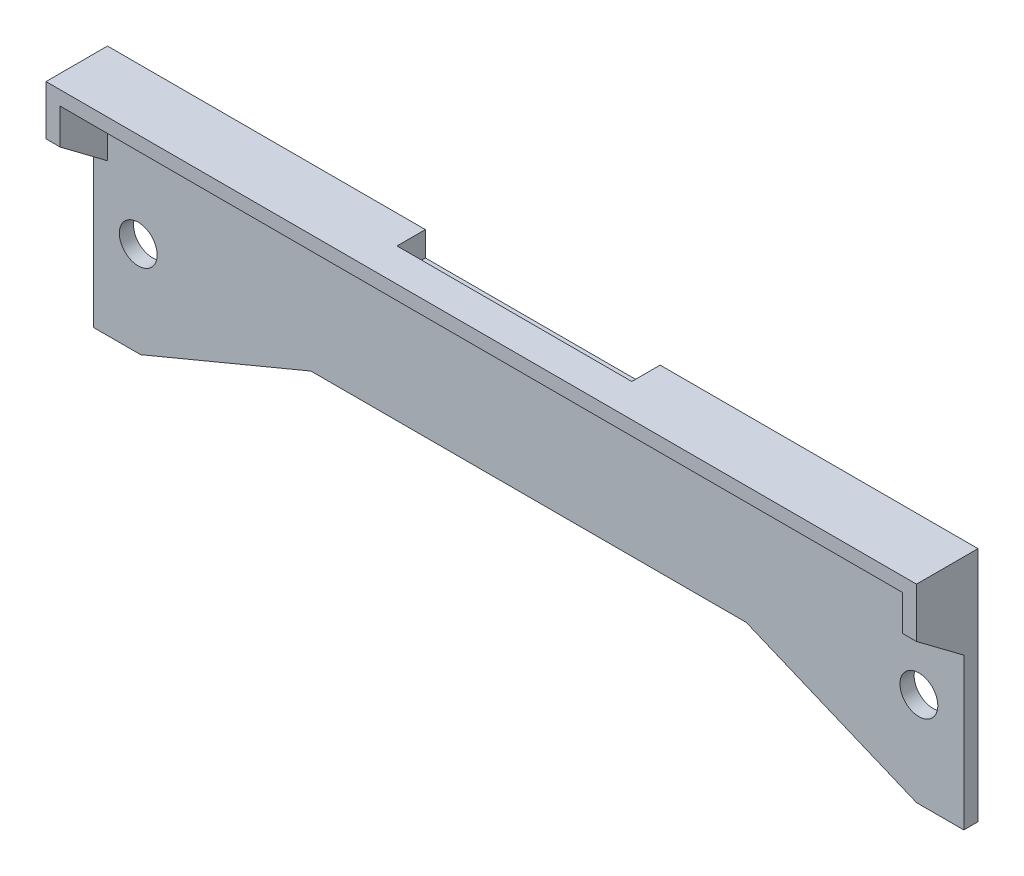
ISO-10303-21;
HEADER;
FILE_DESCRIPTION(('STEP AP214'),'2;1');
FILE_NAME('part.step','',(''),(''),'','','');
FILE_SCHEMA(('AUTOMOTIVE_DESIGN { 1 0 10303 214 1 1 1 1 }'));
ENDSEC;
DATA;
#1=APPLICATION_CONTEXT('core data for automotive mechanical design processes');
#2=APPLICATION_PROTOCOL_DEFINITION('international standard','automotive_design',2000,#1);
#3=PRODUCT_CONTEXT('',#1,'mechanical');
#4=PRODUCT('Part','Part','',(#3));
#5=PRODUCT_RELATED_PRODUCT_CATEGORY('part','',(#4));
#6=PRODUCT_DEFINITION_FORMATION('','',#4);
#7=PRODUCT_DEFINITION_CONTEXT('part definition',#1,'design');
#8=PRODUCT_DEFINITION('design','',#6,#7);
#9=PRODUCT_DEFINITION_SHAPE('','',#8);
#10=(LENGTH_UNIT() NAMED_UNIT(*) SI_UNIT(.MILLI.,.METRE.));
#11=(NAMED_UNIT(*) PLANE_ANGLE_UNIT() SI_UNIT($,.RADIAN.));
#12=(NAMED_UNIT(*) SI_UNIT($,.STERADIAN.) SOLID_ANGLE_UNIT());
#13=UNCERTAINTY_MEASURE_WITH_UNIT(LENGTH_MEASURE(1.E-05),#10,'distance_accuracy_value','');
#14=(GEOMETRIC_REPRESENTATION_CONTEXT(3) GLOBAL_UNCERTAINTY_ASSIGNED_CONTEXT((#13)) GLOBAL_UNIT_ASSIGNED_CONTEXT((#10,
#11,#12)) REPRESENTATION_CONTEXT('',''));
#15=CARTESIAN_POINT('',(0.,0.,0.));
#16=DIRECTION('',(0.,0.,1.));
#17=DIRECTION('',(1.,0.,0.));
#18=AXIS2_PLACEMENT_3D('',#15,#16,#17);
#19=CARTESIAN_POINT('',(0.,0.,3.));
#20=DIRECTION('',(0.,0.,-1.));
#21=DIRECTION('',(-1.,0.,0.));
#22=AXIS2_PLACEMENT_3D('',#19,#20,#21);
#23=PLANE('',#22);
#24=CARTESIAN_POINT('',(9.5,20.,3.));
#25=DIRECTION('',(0.,0.,1.));
#26=DIRECTION('',(1.,0.,0.));
#27=AXIS2_PLACEMENT_3D('',#24,#25,#26);
#28=CIRCLE('',#27,4.00000000000001);
#29=CARTESIAN_POINT('',(13.5,20.,3.));
#30=VERTEX_POINT('',#29);
#31=EDGE_CURVE('E282',#30,#30,#28,.T.);
#32=ORIENTED_EDGE('',*,*,#31,.F.);
#33=EDGE_LOOP('',(#32));
#34=FACE_BOUND('',#33,.T.);
#35=CARTESIAN_POINT('',(174.5,20.,3.));
#36=DIRECTION('',(0.,0.,1.));
#37=DIRECTION('',(-1.,0.,0.));
#38=AXIS2_PLACEMENT_3D('',#35,#36,#37);
#39=CIRCLE('',#38,3.99999999999999);
#40=CARTESIAN_POINT('',(170.5,20.,3.));
#41=VERTEX_POINT('',#40);
#42=EDGE_CURVE('E276',#41,#41,#39,.T.);
#43=ORIENTED_EDGE('',*,*,#42,.F.);
#44=EDGE_LOOP('',(#43));
#45=FACE_BOUND('',#44,.T.);
#46=DIRECTION('',(0.923076923076923,-0.384615384615384,0.));
#47=VECTOR('',#46,1.);
#48=CARTESIAN_POINT('',(25.7396449704142,61.7751479289941,3.));
#49=LINE('',#48,#47);
#50=CARTESIAN_POINT('',(138.,15.,3.));
#51=VERTEX_POINT('',#50);
#52=CARTESIAN_POINT('',(174.,0.,3.));
#53=VERTEX_POINT('',#52);
#54=EDGE_CURVE('E181',#51,#53,#49,.T.);
#55=ORIENTED_EDGE('',*,*,#54,.T.);
#56=DIRECTION('',(1.,0.,0.));
#57=VECTOR('',#56,1.);
#58=CARTESIAN_POINT('',(0.,0.,3.));
#59=LINE('',#58,#57);
#60=CARTESIAN_POINT('',(184.,0.,3.));
#61=VERTEX_POINT('',#60);
#62=EDGE_CURVE('E290',#53,#61,#59,.T.);
#63=ORIENTED_EDGE('',*,*,#62,.T.);
#64=DIRECTION('',(0.,1.,0.));
#65=VECTOR('',#64,1.);
#66=CARTESIAN_POINT('',(184.,0.,3.));
#67=LINE('',#66,#65);
#68=CARTESIAN_POINT('',(184.,32.,3.));
#69=VERTEX_POINT('',#68);
#70=EDGE_CURVE('E294',#61,#69,#67,.T.);
#71=ORIENTED_EDGE('',*,*,#70,.T.);
#72=DIRECTION('',(1.,0.,0.));
#73=VECTOR('',#72,1.);
#74=CARTESIAN_POINT('',(181.,32.,3.));
#75=LINE('',#74,#73);
#76=CARTESIAN_POINT('',(181.,32.,3.));
#77=VERTEX_POINT('',#76);
#78=EDGE_CURVE('E253',#77,#69,#75,.T.);
#79=ORIENTED_EDGE('',*,*,#78,.F.);
#80=DIRECTION('',(0.,1.,0.));
#81=VECTOR('',#80,1.);
#82=CARTESIAN_POINT('',(181.,32.,3.));
#83=LINE('',#82,#81);
#84=CARTESIAN_POINT('',(181.,47.,3.));
#85=VERTEX_POINT('',#84);
#86=EDGE_CURVE('E250',#77,#85,#83,.T.);
#87=ORIENTED_EDGE('',*,*,#86,.T.);
#88=DIRECTION('',(1.,0.,0.));
#89=VECTOR('',#88,1.);
#90=CARTESIAN_POINT('',(0.,47.,3.));
#91=LINE('',#90,#89);
#92=CARTESIAN_POINT('',(116.811209828697,47.,3.));
#93=VERTEX_POINT('',#92);
#94=EDGE_CURVE('E271',#93,#85,#91,.T.);
#95=ORIENTED_EDGE('',*,*,#94,.F.);
#96=DIRECTION('',(0.,-1.,0.));
#97=VECTOR('',#96,1.);
#98=CARTESIAN_POINT('',(116.811209828697,0.,3.));
#99=LINE('',#98,#97);
#100=CARTESIAN_POINT('',(116.811209828697,44.8066347129542,3.));
#101=VERTEX_POINT('',#100);
#102=EDGE_CURVE('E235',#93,#101,#99,.T.);
#103=ORIENTED_EDGE('',*,*,#102,.T.);
#104=DIRECTION('',(-1.,0.,0.));
#105=VECTOR('',#104,1.);
#106=CARTESIAN_POINT('',(0.,44.8066347129542,3.));
#107=LINE('',#106,#105);
#108=CARTESIAN_POINT('',(67.1887901713027,44.8066347129542,3.));
#109=VERTEX_POINT('',#108);
#110=EDGE_CURVE('E241',#101,#109,#107,.T.);
#111=ORIENTED_EDGE('',*,*,#110,.T.);
#112=DIRECTION('',(0.,1.,0.));
#113=VECTOR('',#112,1.);
#114=CARTESIAN_POINT('',(67.1887901713027,0.,3.));
#115=LINE('',#114,#113);
#116=CARTESIAN_POINT('',(67.1887901713027,47.,3.));
#117=VERTEX_POINT('',#116);
#118=EDGE_CURVE('E229',#109,#117,#115,.T.);
#119=ORIENTED_EDGE('',*,*,#118,.T.);
#120=CARTESIAN_POINT('',(3.,47.,3.));
#121=VERTEX_POINT('',#120);
#122=EDGE_CURVE('E272',#121,#117,#91,.T.);
#123=ORIENTED_EDGE('',*,*,#122,.F.);
#124=DIRECTION('',(0.,-1.,0.));
#125=VECTOR('',#124,1.);
#126=CARTESIAN_POINT('',(3.,47.,3.));
#127=LINE('',#126,#125);
#128=CARTESIAN_POINT('',(3.,32.,3.));
#129=VERTEX_POINT('',#128);
#130=EDGE_CURVE('E263',#121,#129,#127,.T.);
#131=ORIENTED_EDGE('',*,*,#130,.T.);
#132=DIRECTION('',(-1.,0.,0.));
#133=VECTOR('',#132,1.);
#134=CARTESIAN_POINT('',(3.,32.,3.));
#135=LINE('',#134,#133);
#136=CARTESIAN_POINT('',(0.,32.,3.));
#137=VERTEX_POINT('',#136);
#138=EDGE_CURVE('E266',#129,#137,#135,.T.);
#139=ORIENTED_EDGE('',*,*,#138,.T.);
#140=DIRECTION('',(0.,-1.,0.));
#141=VECTOR('',#140,1.);
#142=CARTESIAN_POINT('',(0.,0.,3.));
#143=LINE('',#142,#141);
#144=CARTESIAN_POINT('',(0.,0.,3.));
#145=VERTEX_POINT('',#144);
#146=EDGE_CURVE('E288',#137,#145,#143,.T.);
#147=ORIENTED_EDGE('',*,*,#146,.T.);
#148=CARTESIAN_POINT('',(10.,0.,3.));
#149=VERTEX_POINT('',#148);
#150=EDGE_CURVE('E292',#145,#149,#59,.T.);
#151=ORIENTED_EDGE('',*,*,#150,.T.);
#152=DIRECTION('',(-0.923076923076923,-0.384615384615384,0.));
#153=VECTOR('',#152,1.);
#154=CARTESIAN_POINT('',(1.4792899408284,-3.55029585798816,3.));
#155=LINE('',#154,#153);
#156=CARTESIAN_POINT('',(46.,15.,3.));
#157=VERTEX_POINT('',#156);
#158=EDGE_CURVE('E48',#157,#149,#155,.T.);
#159=ORIENTED_EDGE('',*,*,#158,.F.);
#160=DIRECTION('',(-1.,0.,0.));
#161=VECTOR('',#160,1.);
#162=CARTESIAN_POINT('',(0.,15.,3.));
#163=LINE('',#162,#161);
#164=EDGE_CURVE('E174',#51,#157,#163,.T.);
#165=ORIENTED_EDGE('',*,*,#164,.F.);
#166=EDGE_LOOP('',(#55,#63,#71,#79,#87,#95,#103,#111,#119,#123,#131,#139,#147,#151,#159,#165));
#167=FACE_BOUND('',#166,.T.);
#168=ADVANCED_FACE('F33',(#34,#45,#167),#23,.F.);
#169=CARTESIAN_POINT('',(0.,0.,0.));
#170=DIRECTION('',(0.,0.,-1.));
#171=DIRECTION('',(-1.,0.,0.));
#172=AXIS2_PLACEMENT_3D('',#169,#170,#171);
#173=PLANE('',#172);
#174=CARTESIAN_POINT('',(9.5,20.,0.));
#175=DIRECTION('',(0.,0.,1.));
#176=DIRECTION('',(1.,0.,0.));
#177=AXIS2_PLACEMENT_3D('',#174,#175,#176);
#178=CIRCLE('',#177,4.00000000000001);
#179=CARTESIAN_POINT('',(13.5,20.,0.));
#180=VERTEX_POINT('',#179);
#181=EDGE_CURVE('E279',#180,#180,#178,.T.);
#182=ORIENTED_EDGE('',*,*,#181,.T.);
#183=EDGE_LOOP('',(#182));
#184=FACE_BOUND('',#183,.T.);
#185=CARTESIAN_POINT('',(174.5,20.,0.));
#186=DIRECTION('',(0.,0.,1.));
#187=DIRECTION('',(-1.,0.,0.));
#188=AXIS2_PLACEMENT_3D('',#185,#186,#187);
#189=CIRCLE('',#188,3.99999999999999);
#190=CARTESIAN_POINT('',(170.5,20.,0.));
#191=VERTEX_POINT('',#190);
#192=EDGE_CURVE('E275',#191,#191,#189,.T.);
#193=ORIENTED_EDGE('',*,*,#192,.T.);
#194=EDGE_LOOP('',(#193));
#195=FACE_BOUND('',#194,.T.);
#196=DIRECTION('',(1.,0.,0.));
#197=VECTOR('',#196,1.);
#198=CARTESIAN_POINT('',(0.,0.,0.));
#199=LINE('',#198,#197);
#200=CARTESIAN_POINT('',(174.,0.,0.));
#201=VERTEX_POINT('',#200);
#202=CARTESIAN_POINT('',(184.,0.,0.));
#203=VERTEX_POINT('',#202);
#204=EDGE_CURVE('E300',#201,#203,#199,.T.);
#205=ORIENTED_EDGE('',*,*,#204,.F.);
#206=DIRECTION('',(-0.923076923076923,0.384615384615384,0.));
#207=VECTOR('',#206,1.);
#208=CARTESIAN_POINT('',(25.7396449704142,61.7751479289941,0.));
#209=LINE('',#208,#207);
#210=CARTESIAN_POINT('',(138.,15.,0.));
#211=VERTEX_POINT('',#210);
#212=EDGE_CURVE('E194',#201,#211,#209,.T.);
#213=ORIENTED_EDGE('',*,*,#212,.T.);
#214=DIRECTION('',(1.,0.,0.));
#215=VECTOR('',#214,1.);
#216=CARTESIAN_POINT('',(0.,15.,0.));
#217=LINE('',#216,#215);
#218=CARTESIAN_POINT('',(46.,15.,0.));
#219=VERTEX_POINT('',#218);
#220=EDGE_CURVE('E11',#219,#211,#217,.T.);
#221=ORIENTED_EDGE('',*,*,#220,.F.);
#222=DIRECTION('',(0.923076923076923,0.384615384615384,0.));
#223=VECTOR('',#222,1.);
#224=CARTESIAN_POINT('',(1.4792899408284,-3.55029585798816,0.));
#225=LINE('',#224,#223);
#226=CARTESIAN_POINT('',(10.,0.,0.));
#227=VERTEX_POINT('',#226);
#228=EDGE_CURVE('E191',#227,#219,#225,.T.);
#229=ORIENTED_EDGE('',*,*,#228,.F.);
#230=CARTESIAN_POINT('',(0.,0.,0.));
#231=VERTEX_POINT('',#230);
#232=EDGE_CURVE('E301',#231,#227,#199,.T.);
#233=ORIENTED_EDGE('',*,*,#232,.F.);
#234=DIRECTION('',(0.,-1.,0.));
#235=VECTOR('',#234,1.);
#236=CARTESIAN_POINT('',(0.,0.,0.));
#237=LINE('',#236,#235);
#238=CARTESIAN_POINT('',(0.,50.,0.));
#239=VERTEX_POINT('',#238);
#240=EDGE_CURVE('E285',#239,#231,#237,.T.);
#241=ORIENTED_EDGE('',*,*,#240,.F.);
#242=DIRECTION('',(-1.,0.,0.));
#243=VECTOR('',#242,1.);
#244=CARTESIAN_POINT('',(0.,50.,0.));
#245=LINE('',#244,#243);
#246=CARTESIAN_POINT('',(67.1887901713027,50.,0.));
#247=VERTEX_POINT('',#246);
#248=EDGE_CURVE('E307',#247,#239,#245,.T.);
#249=ORIENTED_EDGE('',*,*,#248,.F.);
#250=DIRECTION('',(0.,1.,0.));
#251=VECTOR('',#250,1.);
#252=CARTESIAN_POINT('',(67.1887901713027,55.1933652870458,0.));
#253=LINE('',#252,#251);
#254=CARTESIAN_POINT('',(67.1887901713027,44.8066347129542,0.));
#255=VERTEX_POINT('',#254);
#256=EDGE_CURVE('E214',#255,#247,#253,.T.);
#257=ORIENTED_EDGE('',*,*,#256,.F.);
#258=DIRECTION('',(-1.,0.,0.));
#259=VECTOR('',#258,1.);
#260=CARTESIAN_POINT('',(67.1887901713027,44.8066347129542,0.));
#261=LINE('',#260,#259);
#262=CARTESIAN_POINT('',(116.811209828697,44.8066347129542,0.));
#263=VERTEX_POINT('',#262);
#264=EDGE_CURVE('E219',#263,#255,#261,.T.);
#265=ORIENTED_EDGE('',*,*,#264,.F.);
#266=DIRECTION('',(0.,-1.,0.));
#267=VECTOR('',#266,1.);
#268=CARTESIAN_POINT('',(116.811209828697,55.1933652870458,0.));
#269=LINE('',#268,#267);
#270=CARTESIAN_POINT('',(116.811209828697,50.,0.));
#271=VERTEX_POINT('',#270);
#272=EDGE_CURVE('E210',#271,#263,#269,.T.);
#273=ORIENTED_EDGE('',*,*,#272,.F.);
#274=CARTESIAN_POINT('',(184.,50.,0.));
#275=VERTEX_POINT('',#274);
#276=EDGE_CURVE('E291',#275,#271,#245,.T.);
#277=ORIENTED_EDGE('',*,*,#276,.F.);
#278=DIRECTION('',(0.,1.,0.));
#279=VECTOR('',#278,1.);
#280=CARTESIAN_POINT('',(184.,0.,0.));
#281=LINE('',#280,#279);
#282=EDGE_CURVE('E304',#203,#275,#281,.T.);
#283=ORIENTED_EDGE('',*,*,#282,.F.);
#284=EDGE_LOOP('',(#205,#213,#221,#229,#233,#241,#249,#257,#265,#273,#277,#283));
#285=FACE_BOUND('',#284,.T.);
#286=ADVANCED_FACE('F344',(#184,#195,#285),#173,.T.);
#287=CARTESIAN_POINT('',(0.,0.,3.));
#288=DIRECTION('',(0.,1.,0.));
#289=DIRECTION('',(-1.,0.,0.));
#290=AXIS2_PLACEMENT_3D('',#287,#288,#289);
#291=PLANE('',#290);
#292=DIRECTION('',(0.,0.,1.));
#293=VECTOR('',#292,1.);
#294=CARTESIAN_POINT('',(174.,0.,3.));
#295=LINE('',#294,#293);
#296=EDGE_CURVE('E41',#201,#53,#295,.T.);
#297=ORIENTED_EDGE('',*,*,#296,.F.);
#298=ORIENTED_EDGE('',*,*,#204,.T.);
#299=DIRECTION('',(0.,0.,-1.));
#300=VECTOR('',#299,1.);
#301=CARTESIAN_POINT('',(184.,0.,3.));
#302=LINE('',#301,#300);
#303=EDGE_CURVE('E313',#61,#203,#302,.T.);
#304=ORIENTED_EDGE('',*,*,#303,.F.);
#305=ORIENTED_EDGE('',*,*,#62,.F.);
#306=EDGE_LOOP('',(#297,#298,#304,#305));
#307=FACE_BOUND('',#306,.T.);
#308=ADVANCED_FACE('F362',(#307),#291,.F.);
#309=CARTESIAN_POINT('',(0.,0.,3.));
#310=DIRECTION('',(1.,0.,0.));
#311=DIRECTION('',(0.,0.,-1.));
#312=AXIS2_PLACEMENT_3D('',#309,#310,#311);
#313=PLANE('',#312);
#314=DIRECTION('',(0.,0.6,0.8));
#315=VECTOR('',#314,1.);
#316=CARTESIAN_POINT('',(0.,32.,3.));
#317=LINE('',#316,#315);
#318=CARTESIAN_POINT('',(0.,39.5,13.));
#319=VERTEX_POINT('',#318);
#320=EDGE_CURVE('E257',#137,#319,#317,.T.);
#321=ORIENTED_EDGE('',*,*,#320,.T.);
#322=DIRECTION('',(0.,1.,0.));
#323=VECTOR('',#322,1.);
#324=CARTESIAN_POINT('',(0.,34.,13.));
#325=LINE('',#324,#323);
#326=CARTESIAN_POINT('',(0.,50.,13.));
#327=VERTEX_POINT('',#326);
#328=EDGE_CURVE('E199',#319,#327,#325,.T.);
#329=ORIENTED_EDGE('',*,*,#328,.T.);
#330=DIRECTION('',(0.,0.,-1.));
#331=VECTOR('',#330,1.);
#332=CARTESIAN_POINT('',(0.,50.,3.));
#333=LINE('',#332,#331);
#334=EDGE_CURVE('E297',#327,#239,#333,.T.);
#335=ORIENTED_EDGE('',*,*,#334,.T.);
#336=ORIENTED_EDGE('',*,*,#240,.T.);
#337=DIRECTION('',(0.,0.,-1.));
#338=VECTOR('',#337,1.);
#339=CARTESIAN_POINT('',(0.,0.,3.));
#340=LINE('',#339,#338);
#341=EDGE_CURVE('E316',#145,#231,#340,.T.);
#342=ORIENTED_EDGE('',*,*,#341,.F.);
#343=ORIENTED_EDGE('',*,*,#146,.F.);
#344=EDGE_LOOP('',(#321,#329,#335,#336,#342,#343));
#345=FACE_BOUND('',#344,.T.);
#346=ADVANCED_FACE('F35',(#345),#313,.F.);
#347=ORIENTED_EDGE('',*,*,#232,.T.);
#348=DIRECTION('',(0.,0.,1.));
#349=VECTOR('',#348,1.);
#350=CARTESIAN_POINT('',(10.,0.,3.));
#351=LINE('',#350,#349);
#352=EDGE_CURVE('E330',#227,#149,#351,.T.);
#353=ORIENTED_EDGE('',*,*,#352,.T.);
#354=ORIENTED_EDGE('',*,*,#150,.F.);
#355=ORIENTED_EDGE('',*,*,#341,.T.);
#356=EDGE_LOOP('',(#347,#353,#354,#355));
#357=FACE_BOUND('',#356,.T.);
#358=ADVANCED_FACE('F333',(#357),#291,.F.);
#359=CARTESIAN_POINT('',(184.,0.,3.));
#360=DIRECTION('',(-1.,0.,0.));
#361=DIRECTION('',(0.,0.,1.));
#362=AXIS2_PLACEMENT_3D('',#359,#360,#361);
#363=PLANE('',#362);
#364=DIRECTION('',(0.,0.,-1.));
#365=VECTOR('',#364,1.);
#366=CARTESIAN_POINT('',(184.,50.,3.));
#367=LINE('',#366,#365);
#368=CARTESIAN_POINT('',(184.,50.,13.));
#369=VERTEX_POINT('',#368);
#370=EDGE_CURVE('E311',#369,#275,#367,.T.);
#371=ORIENTED_EDGE('',*,*,#370,.F.);
#372=DIRECTION('',(0.,1.,0.));
#373=VECTOR('',#372,1.);
#374=CARTESIAN_POINT('',(184.,34.,13.));
#375=LINE('',#374,#373);
#376=CARTESIAN_POINT('',(184.,39.5,13.));
#377=VERTEX_POINT('',#376);
#378=EDGE_CURVE('E198',#377,#369,#375,.T.);
#379=ORIENTED_EDGE('',*,*,#378,.F.);
#380=DIRECTION('',(0.,-0.6,-0.8));
#381=VECTOR('',#380,1.);
#382=CARTESIAN_POINT('',(184.,47.,23.));
#383=LINE('',#382,#381);
#384=EDGE_CURVE('E244',#377,#69,#383,.T.);
#385=ORIENTED_EDGE('',*,*,#384,.T.);
#386=ORIENTED_EDGE('',*,*,#70,.F.);
#387=ORIENTED_EDGE('',*,*,#303,.T.);
#388=ORIENTED_EDGE('',*,*,#282,.T.);
#389=EDGE_LOOP('',(#371,#379,#385,#386,#387,#388));
#390=FACE_BOUND('',#389,.T.);
#391=ADVANCED_FACE('F374',(#390),#363,.F.);
#392=CARTESIAN_POINT('',(0.,50.,3.));
#393=DIRECTION('',(0.,-1.,0.));
#394=DIRECTION('',(1.,0.,0.));
#395=AXIS2_PLACEMENT_3D('',#392,#393,#394);
#396=PLANE('',#395);
#397=ORIENTED_EDGE('',*,*,#334,.F.);
#398=DIRECTION('',(-1.,0.,0.));
#399=VECTOR('',#398,1.);
#400=CARTESIAN_POINT('',(184.,50.,13.));
#401=LINE('',#400,#399);
#402=EDGE_CURVE('E196',#369,#327,#401,.T.);
#403=ORIENTED_EDGE('',*,*,#402,.F.);
#404=ORIENTED_EDGE('',*,*,#370,.T.);
#405=ORIENTED_EDGE('',*,*,#276,.T.);
#406=DIRECTION('',(0.,0.,1.));
#407=VECTOR('',#406,1.);
#408=CARTESIAN_POINT('',(116.811209828697,50.,3.));
#409=LINE('',#408,#407);
#410=CARTESIAN_POINT('',(116.811209828697,50.,6.));
#411=VERTEX_POINT('',#410);
#412=EDGE_CURVE('E238',#271,#411,#409,.T.);
#413=ORIENTED_EDGE('',*,*,#412,.T.);
#414=DIRECTION('',(-1.,0.,0.));
#415=VECTOR('',#414,1.);
#416=CARTESIAN_POINT('',(0.,50.,6.));
#417=LINE('',#416,#415);
#418=CARTESIAN_POINT('',(67.1887901713027,50.,6.));
#419=VERTEX_POINT('',#418);
#420=EDGE_CURVE('E225',#411,#419,#417,.T.);
#421=ORIENTED_EDGE('',*,*,#420,.T.);
#422=DIRECTION('',(0.,0.,-1.));
#423=VECTOR('',#422,1.);
#424=CARTESIAN_POINT('',(67.1887901713027,50.,3.));
#425=LINE('',#424,#423);
#426=EDGE_CURVE('E232',#419,#247,#425,.T.);
#427=ORIENTED_EDGE('',*,*,#426,.T.);
#428=ORIENTED_EDGE('',*,*,#248,.T.);
#429=EDGE_LOOP('',(#397,#403,#404,#405,#413,#421,#427,#428));
#430=FACE_BOUND('',#429,.T.);
#431=ADVANCED_FACE('F371',(#430),#396,.F.);
#432=CARTESIAN_POINT('',(9.5,20.,3.));
#433=DIRECTION('',(0.,0.,-1.));
#434=DIRECTION('',(-1.,0.,0.));
#435=AXIS2_PLACEMENT_3D('',#432,#433,#434);
#436=CYLINDRICAL_SURFACE('',#435,4.00000000000001);
#437=ORIENTED_EDGE('',*,*,#31,.T.);
#438=EDGE_LOOP('',(#437));
#439=FACE_BOUND('',#438,.T.);
#440=ORIENTED_EDGE('',*,*,#181,.F.);
#441=EDGE_LOOP('',(#440));
#442=FACE_BOUND('',#441,.T.);
#443=ADVANCED_FACE('F368',(#439,#442),#436,.F.);
#444=CARTESIAN_POINT('',(174.5,20.,3.));
#445=DIRECTION('',(0.,0.,-1.));
#446=DIRECTION('',(-1.,0.,0.));
#447=AXIS2_PLACEMENT_3D('',#444,#445,#446);
#448=CYLINDRICAL_SURFACE('',#447,3.99999999999999);
#449=ORIENTED_EDGE('',*,*,#42,.T.);
#450=EDGE_LOOP('',(#449));
#451=FACE_BOUND('',#450,.T.);
#452=ORIENTED_EDGE('',*,*,#192,.F.);
#453=EDGE_LOOP('',(#452));
#454=FACE_BOUND('',#453,.T.);
#455=ADVANCED_FACE('F454',(#451,#454),#448,.F.);
#456=CARTESIAN_POINT('',(0.,47.,23.));
#457=DIRECTION('',(0.,1.,0.));
#458=DIRECTION('',(0.,0.,1.));
#459=AXIS2_PLACEMENT_3D('',#456,#457,#458);
#460=PLANE('',#459);
#461=DIRECTION('',(0.,0.,1.));
#462=VECTOR('',#461,1.);
#463=CARTESIAN_POINT('',(181.,47.,3.));
#464=LINE('',#463,#462);
#465=CARTESIAN_POINT('',(181.,47.,13.));
#466=VERTEX_POINT('',#465);
#467=EDGE_CURVE('E245',#85,#466,#464,.T.);
#468=ORIENTED_EDGE('',*,*,#467,.T.);
#469=DIRECTION('',(-1.,0.,0.));
#470=VECTOR('',#469,1.);
#471=CARTESIAN_POINT('',(0.,47.,13.));
#472=LINE('',#471,#470);
#473=CARTESIAN_POINT('',(3.,47.,13.));
#474=VERTEX_POINT('',#473);
#475=EDGE_CURVE('E56',#466,#474,#472,.T.);
#476=ORIENTED_EDGE('',*,*,#475,.T.);
#477=DIRECTION('',(0.,0.,-1.));
#478=VECTOR('',#477,1.);
#479=CARTESIAN_POINT('',(3.,47.,23.));
#480=LINE('',#479,#478);
#481=EDGE_CURVE('E261',#474,#121,#480,.T.);
#482=ORIENTED_EDGE('',*,*,#481,.T.);
#483=ORIENTED_EDGE('',*,*,#122,.T.);
#484=DIRECTION('',(0.,0.,1.));
#485=VECTOR('',#484,1.);
#486=CARTESIAN_POINT('',(67.1887901713027,47.,23.));
#487=LINE('',#486,#485);
#488=CARTESIAN_POINT('',(67.1887901713027,47.,6.));
#489=VERTEX_POINT('',#488);
#490=EDGE_CURVE('E322',#117,#489,#487,.T.);
#491=ORIENTED_EDGE('',*,*,#490,.T.);
#492=DIRECTION('',(1.,0.,0.));
#493=VECTOR('',#492,1.);
#494=CARTESIAN_POINT('',(0.,47.,6.));
#495=LINE('',#494,#493);
#496=CARTESIAN_POINT('',(116.811209828697,47.,6.));
#497=VERTEX_POINT('',#496);
#498=EDGE_CURVE('E319',#489,#497,#495,.T.);
#499=ORIENTED_EDGE('',*,*,#498,.T.);
#500=DIRECTION('',(0.,0.,-1.));
#501=VECTOR('',#500,1.);
#502=CARTESIAN_POINT('',(116.811209828697,47.,23.));
#503=LINE('',#502,#501);
#504=EDGE_CURVE('E325',#497,#93,#503,.T.);
#505=ORIENTED_EDGE('',*,*,#504,.T.);
#506=ORIENTED_EDGE('',*,*,#94,.T.);
#507=EDGE_LOOP('',(#468,#476,#482,#483,#491,#499,#505,#506));
#508=FACE_BOUND('',#507,.T.);
#509=ADVANCED_FACE('F405',(#508),#460,.F.);
#510=CARTESIAN_POINT('',(3.,32.,3.));
#511=DIRECTION('',(0.,-0.8,0.6));
#512=DIRECTION('',(0.,-0.6,-0.8));
#513=AXIS2_PLACEMENT_3D('',#510,#511,#512);
#514=PLANE('',#513);
#515=DIRECTION('',(1.,0.,0.));
#516=VECTOR('',#515,1.);
#517=CARTESIAN_POINT('',(3.,39.5,13.));
#518=LINE('',#517,#516);
#519=CARTESIAN_POINT('',(3.,39.5,13.));
#520=VERTEX_POINT('',#519);
#521=EDGE_CURVE('E208',#319,#520,#518,.T.);
#522=ORIENTED_EDGE('',*,*,#521,.F.);
#523=ORIENTED_EDGE('',*,*,#320,.F.);
#524=ORIENTED_EDGE('',*,*,#138,.F.);
#525=DIRECTION('',(0.,0.6,0.8));
#526=VECTOR('',#525,1.);
#527=CARTESIAN_POINT('',(3.,32.,3.));
#528=LINE('',#527,#526);
#529=EDGE_CURVE('E258',#129,#520,#528,.T.);
#530=ORIENTED_EDGE('',*,*,#529,.T.);
#531=EDGE_LOOP('',(#522,#523,#524,#530));
#532=FACE_BOUND('',#531,.T.);
#533=ADVANCED_FACE('F428',(#532),#514,.T.);
#534=CARTESIAN_POINT('',(3.,0.,0.));
#535=DIRECTION('',(1.,0.,0.));
#536=DIRECTION('',(0.,0.,-1.));
#537=AXIS2_PLACEMENT_3D('',#534,#535,#536);
#538=PLANE('',#537);
#539=DIRECTION('',(0.,1.,0.));
#540=VECTOR('',#539,1.);
#541=CARTESIAN_POINT('',(3.,0.,13.));
#542=LINE('',#541,#540);
#543=EDGE_CURVE('E206',#520,#474,#542,.T.);
#544=ORIENTED_EDGE('',*,*,#543,.F.);
#545=ORIENTED_EDGE('',*,*,#529,.F.);
#546=ORIENTED_EDGE('',*,*,#130,.F.);
#547=ORIENTED_EDGE('',*,*,#481,.F.);
#548=EDGE_LOOP('',(#544,#545,#546,#547));
#549=FACE_BOUND('',#548,.T.);
#550=ADVANCED_FACE('F425',(#549),#538,.T.);
#551=CARTESIAN_POINT('',(181.,47.,23.));
#552=DIRECTION('',(0.,-0.8,0.6));
#553=DIRECTION('',(0.,-0.6,-0.8));
#554=AXIS2_PLACEMENT_3D('',#551,#552,#553);
#555=PLANE('',#554);
#556=DIRECTION('',(1.,0.,0.));
#557=VECTOR('',#556,1.);
#558=CARTESIAN_POINT('',(181.,39.5,13.));
#559=LINE('',#558,#557);
#560=CARTESIAN_POINT('',(181.,39.5,13.));
#561=VERTEX_POINT('',#560);
#562=EDGE_CURVE('E202',#561,#377,#559,.T.);
#563=ORIENTED_EDGE('',*,*,#562,.F.);
#564=DIRECTION('',(0.,-0.6,-0.8));
#565=VECTOR('',#564,1.);
#566=CARTESIAN_POINT('',(181.,47.,23.));
#567=LINE('',#566,#565);
#568=EDGE_CURVE('E248',#561,#77,#567,.T.);
#569=ORIENTED_EDGE('',*,*,#568,.T.);
#570=ORIENTED_EDGE('',*,*,#78,.T.);
#571=ORIENTED_EDGE('',*,*,#384,.F.);
#572=EDGE_LOOP('',(#563,#569,#570,#571));
#573=FACE_BOUND('',#572,.T.);
#574=ADVANCED_FACE('F399',(#573),#555,.T.);
#575=CARTESIAN_POINT('',(181.,0.,0.));
#576=DIRECTION('',(-1.,0.,0.));
#577=DIRECTION('',(0.,0.,1.));
#578=AXIS2_PLACEMENT_3D('',#575,#576,#577);
#579=PLANE('',#578);
#580=DIRECTION('',(0.,-1.,0.));
#581=VECTOR('',#580,1.);
#582=CARTESIAN_POINT('',(181.,0.,13.));
#583=LINE('',#582,#581);
#584=EDGE_CURVE('E328',#466,#561,#583,.T.);
#585=ORIENTED_EDGE('',*,*,#584,.F.);
#586=ORIENTED_EDGE('',*,*,#467,.F.);
#587=ORIENTED_EDGE('',*,*,#86,.F.);
#588=ORIENTED_EDGE('',*,*,#568,.F.);
#589=EDGE_LOOP('',(#585,#586,#587,#588));
#590=FACE_BOUND('',#589,.T.);
#591=ADVANCED_FACE('F403',(#590),#579,.T.);
#592=CARTESIAN_POINT('',(67.1887901713027,44.8066347129542,6.));
#593=DIRECTION('',(0.,-1.,0.));
#594=DIRECTION('',(1.,0.,0.));
#595=AXIS2_PLACEMENT_3D('',#592,#593,#594);
#596=PLANE('',#595);
#597=DIRECTION('',(0.,0.,-1.));
#598=VECTOR('',#597,1.);
#599=CARTESIAN_POINT('',(116.811209828697,44.8066347129542,6.));
#600=LINE('',#599,#598);
#601=EDGE_CURVE('E216',#101,#263,#600,.T.);
#602=ORIENTED_EDGE('',*,*,#601,.T.);
#603=ORIENTED_EDGE('',*,*,#264,.T.);
#604=DIRECTION('',(0.,0.,-1.));
#605=VECTOR('',#604,1.);
#606=CARTESIAN_POINT('',(67.1887901713027,44.8066347129542,6.));
#607=LINE('',#606,#605);
#608=EDGE_CURVE('E223',#109,#255,#607,.T.);
#609=ORIENTED_EDGE('',*,*,#608,.F.);
#610=ORIENTED_EDGE('',*,*,#110,.F.);
#611=EDGE_LOOP('',(#602,#603,#609,#610));
#612=FACE_BOUND('',#611,.T.);
#613=ADVANCED_FACE('F414',(#612),#596,.F.);
#614=CARTESIAN_POINT('',(116.811209828697,55.1933652870458,6.));
#615=DIRECTION('',(1.,0.,0.));
#616=DIRECTION('',(0.,0.,-1.));
#617=AXIS2_PLACEMENT_3D('',#614,#615,#616);
#618=PLANE('',#617);
#619=ORIENTED_EDGE('',*,*,#272,.T.);
#620=ORIENTED_EDGE('',*,*,#601,.F.);
#621=ORIENTED_EDGE('',*,*,#102,.F.);
#622=ORIENTED_EDGE('',*,*,#504,.F.);
#623=DIRECTION('',(0.,-1.,0.));
#624=VECTOR('',#623,1.);
#625=CARTESIAN_POINT('',(116.811209828697,55.1933652870458,6.));
#626=LINE('',#625,#624);
#627=EDGE_CURVE('E211',#411,#497,#626,.T.);
#628=ORIENTED_EDGE('',*,*,#627,.F.);
#629=ORIENTED_EDGE('',*,*,#412,.F.);
#630=EDGE_LOOP('',(#619,#620,#621,#622,#628,#629));
#631=FACE_BOUND('',#630,.T.);
#632=ADVANCED_FACE('F410',(#631),#618,.F.);
#633=CARTESIAN_POINT('',(67.1887901713027,55.1933652870458,6.));
#634=DIRECTION('',(-1.,0.,0.));
#635=DIRECTION('',(0.,0.,1.));
#636=AXIS2_PLACEMENT_3D('',#633,#634,#635);
#637=PLANE('',#636);
#638=DIRECTION('',(0.,1.,0.));
#639=VECTOR('',#638,1.);
#640=CARTESIAN_POINT('',(67.1887901713027,55.1933652870458,6.));
#641=LINE('',#640,#639);
#642=EDGE_CURVE('E213',#489,#419,#641,.T.);
#643=ORIENTED_EDGE('',*,*,#642,.F.);
#644=ORIENTED_EDGE('',*,*,#490,.F.);
#645=ORIENTED_EDGE('',*,*,#118,.F.);
#646=ORIENTED_EDGE('',*,*,#608,.T.);
#647=ORIENTED_EDGE('',*,*,#256,.T.);
#648=ORIENTED_EDGE('',*,*,#426,.F.);
#649=EDGE_LOOP('',(#643,#644,#645,#646,#647,#648));
#650=FACE_BOUND('',#649,.T.);
#651=ADVANCED_FACE('F418',(#650),#637,.F.);
#652=CARTESIAN_POINT('',(0.,0.,6.));
#653=DIRECTION('',(0.,0.,1.));
#654=DIRECTION('',(1.,0.,0.));
#655=AXIS2_PLACEMENT_3D('',#652,#653,#654);
#656=PLANE('',#655);
#657=ORIENTED_EDGE('',*,*,#627,.T.);
#658=ORIENTED_EDGE('',*,*,#498,.F.);
#659=ORIENTED_EDGE('',*,*,#642,.T.);
#660=ORIENTED_EDGE('',*,*,#420,.F.);
#661=EDGE_LOOP('',(#657,#658,#659,#660));
#662=FACE_BOUND('',#661,.T.);
#663=ADVANCED_FACE('F431',(#662),#656,.F.);
#664=CARTESIAN_POINT('',(184.,34.,13.));
#665=DIRECTION('',(0.,0.,-1.));
#666=DIRECTION('',(-1.,0.,0.));
#667=AXIS2_PLACEMENT_3D('',#664,#665,#666);
#668=PLANE('',#667);
#669=ORIENTED_EDGE('',*,*,#521,.T.);
#670=ORIENTED_EDGE('',*,*,#543,.T.);
#671=ORIENTED_EDGE('',*,*,#475,.F.);
#672=ORIENTED_EDGE('',*,*,#584,.T.);
#673=ORIENTED_EDGE('',*,*,#562,.T.);
#674=ORIENTED_EDGE('',*,*,#378,.T.);
#675=ORIENTED_EDGE('',*,*,#402,.T.);
#676=ORIENTED_EDGE('',*,*,#328,.F.);
#677=EDGE_LOOP('',(#669,#670,#671,#672,#673,#674,#675,#676));
#678=FACE_BOUND('',#677,.T.);
#679=ADVANCED_FACE('F354',(#678),#668,.F.);
#680=CARTESIAN_POINT('',(25.7396449704142,61.7751479289941,-13.));
#681=DIRECTION('',(-0.384615384615384,-0.923076923076923,0.));
#682=DIRECTION('',(0.923076923076923,-0.384615384615384,0.));
#683=AXIS2_PLACEMENT_3D('',#680,#681,#682);
#684=PLANE('',#683);
#685=ORIENTED_EDGE('',*,*,#296,.T.);
#686=ORIENTED_EDGE('',*,*,#54,.F.);
#687=DIRECTION('',(0.,0.,1.));
#688=VECTOR('',#687,1.);
#689=CARTESIAN_POINT('',(138.,15.,-13.));
#690=LINE('',#689,#688);
#691=EDGE_CURVE('E169',#211,#51,#690,.T.);
#692=ORIENTED_EDGE('',*,*,#691,.F.);
#693=ORIENTED_EDGE('',*,*,#212,.F.);
#694=EDGE_LOOP('',(#685,#686,#692,#693));
#695=FACE_BOUND('',#694,.T.);
#696=ADVANCED_FACE('F182',(#695),#684,.T.);
#697=CARTESIAN_POINT('',(1.4792899408284,-3.55029585798816,-13.));
#698=DIRECTION('',(-0.384615384615384,0.923076923076923,0.));
#699=DIRECTION('',(-0.923076923076923,-0.384615384615384,0.));
#700=AXIS2_PLACEMENT_3D('',#697,#698,#699);
#701=PLANE('',#700);
#702=ORIENTED_EDGE('',*,*,#228,.T.);
#703=DIRECTION('',(0.,0.,1.));
#704=VECTOR('',#703,1.);
#705=CARTESIAN_POINT('',(46.,15.,-13.));
#706=LINE('',#705,#704);
#707=EDGE_CURVE('E178',#219,#157,#706,.T.);
#708=ORIENTED_EDGE('',*,*,#707,.T.);
#709=ORIENTED_EDGE('',*,*,#158,.T.);
#710=ORIENTED_EDGE('',*,*,#352,.F.);
#711=EDGE_LOOP('',(#702,#708,#709,#710));
#712=FACE_BOUND('',#711,.T.);
#713=ADVANCED_FACE('F346',(#712),#701,.F.);
#714=CARTESIAN_POINT('',(0.,15.,-13.));
#715=DIRECTION('',(0.,1.,0.));
#716=DIRECTION('',(0.,0.,1.));
#717=AXIS2_PLACEMENT_3D('',#714,#715,#716);
#718=PLANE('',#717);
#719=ORIENTED_EDGE('',*,*,#220,.T.);
#720=ORIENTED_EDGE('',*,*,#691,.T.);
#721=ORIENTED_EDGE('',*,*,#164,.T.);
#722=ORIENTED_EDGE('',*,*,#707,.F.);
#723=EDGE_LOOP('',(#719,#720,#721,#722));
#724=FACE_BOUND('',#723,.T.);
#725=ADVANCED_FACE('F171',(#724),#718,.F.);
#726=CLOSED_SHELL('',(#168,#286,#308,#346,#358,#391,#431,#443,#455,#509,#533,#550,#574,#591,
#613,#632,#651,#663,#679,#696,#713,#725));
#727=MANIFOLD_SOLID_BREP('B2',#726);
#728=ADVANCED_BREP_SHAPE_REPRESENTATION('',(#18,#727),#14);
#729=SHAPE_DEFINITION_REPRESENTATION(#9,#728);
ENDSEC;
END-ISO-10303-21;
